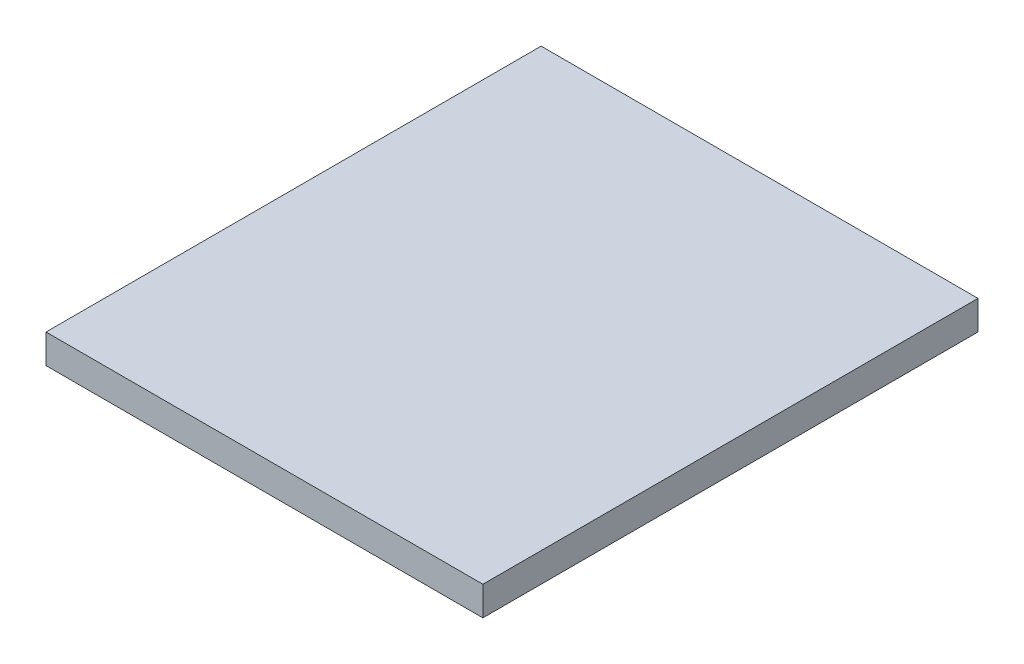
ISO-10303-21;
HEADER;
FILE_DESCRIPTION(('STEP AP214'),'2;1');
FILE_NAME('part.step','',(''),(''),'','','');
FILE_SCHEMA(('AUTOMOTIVE_DESIGN { 1 0 10303 214 1 1 1 1 }'));
ENDSEC;
DATA;
#1=APPLICATION_CONTEXT('core data for automotive mechanical design processes');
#2=APPLICATION_PROTOCOL_DEFINITION('international standard','automotive_design',2000,#1);
#3=PRODUCT_CONTEXT('',#1,'mechanical');
#4=PRODUCT('Part','Part','',(#3));
#5=PRODUCT_RELATED_PRODUCT_CATEGORY('part','',(#4));
#6=PRODUCT_DEFINITION_FORMATION('','',#4);
#7=PRODUCT_DEFINITION_CONTEXT('part definition',#1,'design');
#8=PRODUCT_DEFINITION('design','',#6,#7);
#9=PRODUCT_DEFINITION_SHAPE('','',#8);
#10=(LENGTH_UNIT() NAMED_UNIT(*) SI_UNIT(.MILLI.,.METRE.));
#11=(NAMED_UNIT(*) PLANE_ANGLE_UNIT() SI_UNIT($,.RADIAN.));
#12=(NAMED_UNIT(*) SI_UNIT($,.STERADIAN.) SOLID_ANGLE_UNIT());
#13=UNCERTAINTY_MEASURE_WITH_UNIT(LENGTH_MEASURE(1.E-05),#10,'distance_accuracy_value','');
#14=(GEOMETRIC_REPRESENTATION_CONTEXT(3) GLOBAL_UNCERTAINTY_ASSIGNED_CONTEXT((#13)) GLOBAL_UNIT_ASSIGNED_CONTEXT((#10,
#11,#12)) REPRESENTATION_CONTEXT('',''));
#15=CARTESIAN_POINT('',(0.,0.,0.));
#16=DIRECTION('',(0.,0.,1.));
#17=DIRECTION('',(1.,0.,0.));
#18=AXIS2_PLACEMENT_3D('',#15,#16,#17);
#19=CARTESIAN_POINT('',(-40.6455813487592,29.20892494929,340.));
#20=DIRECTION('',(1.,0.,0.));
#21=DIRECTION('',(0.,0.,-1.));
#22=AXIS2_PLACEMENT_3D('',#19,#20,#21);
#23=PLANE('',#22);
#24=DIRECTION('',(0.,-1.,0.));
#25=VECTOR('',#24,1.);
#26=CARTESIAN_POINT('',(-40.6455813487592,29.20892494929,0.));
#27=LINE('',#26,#25);
#28=CARTESIAN_POINT('',(-40.6455813487592,29.20892494929,0.));
#29=VERTEX_POINT('',#28);
#30=CARTESIAN_POINT('',(-40.6455813487592,9.20892494929004,0.));
#31=VERTEX_POINT('',#30);
#32=EDGE_CURVE('E96',#29,#31,#27,.T.);
#33=ORIENTED_EDGE('',*,*,#32,.T.);
#34=DIRECTION('',(0.,0.,-1.));
#35=VECTOR('',#34,1.);
#36=CARTESIAN_POINT('',(-40.6455813487592,9.20892494929004,340.));
#37=LINE('',#36,#35);
#38=CARTESIAN_POINT('',(-40.6455813487592,9.20892494929004,340.));
#39=VERTEX_POINT('',#38);
#40=EDGE_CURVE('E11',#39,#31,#37,.T.);
#41=ORIENTED_EDGE('',*,*,#40,.F.);
#42=DIRECTION('',(0.,-1.,0.));
#43=VECTOR('',#42,1.);
#44=CARTESIAN_POINT('',(-40.6455813487592,29.20892494929,340.));
#45=LINE('',#44,#43);
#46=CARTESIAN_POINT('',(-40.6455813487592,29.20892494929,340.));
#47=VERTEX_POINT('',#46);
#48=EDGE_CURVE('E84',#47,#39,#45,.T.);
#49=ORIENTED_EDGE('',*,*,#48,.F.);
#50=DIRECTION('',(0.,0.,-1.));
#51=VECTOR('',#50,1.);
#52=CARTESIAN_POINT('',(-40.6455813487592,29.20892494929,340.));
#53=LINE('',#52,#51);
#54=EDGE_CURVE('E92',#47,#29,#53,.T.);
#55=ORIENTED_EDGE('',*,*,#54,.T.);
#56=EDGE_LOOP('',(#33,#41,#49,#55));
#57=FACE_BOUND('',#56,.T.);
#58=ADVANCED_FACE('F33',(#57),#23,.F.);
#59=CARTESIAN_POINT('',(-40.6455813487592,9.20892494929004,340.));
#60=DIRECTION('',(0.,1.,0.));
#61=DIRECTION('',(0.,0.,1.));
#62=AXIS2_PLACEMENT_3D('',#59,#60,#61);
#63=PLANE('',#62);
#64=DIRECTION('',(1.,0.,0.));
#65=VECTOR('',#64,1.);
#66=CARTESIAN_POINT('',(-40.6455813487592,9.20892494929004,0.));
#67=LINE('',#66,#65);
#68=CARTESIAN_POINT('',(259.354418651241,9.20892494929004,0.));
#69=VERTEX_POINT('',#68);
#70=EDGE_CURVE('E88',#31,#69,#67,.T.);
#71=ORIENTED_EDGE('',*,*,#70,.T.);
#72=DIRECTION('',(0.,0.,-1.));
#73=VECTOR('',#72,1.);
#74=CARTESIAN_POINT('',(259.354418651241,9.20892494929004,340.));
#75=LINE('',#74,#73);
#76=CARTESIAN_POINT('',(259.354418651241,9.20892494929004,340.));
#77=VERTEX_POINT('',#76);
#78=EDGE_CURVE('E41',#77,#69,#75,.T.);
#79=ORIENTED_EDGE('',*,*,#78,.F.);
#80=DIRECTION('',(1.,0.,0.));
#81=VECTOR('',#80,1.);
#82=CARTESIAN_POINT('',(-40.6455813487592,9.20892494929004,340.));
#83=LINE('',#82,#81);
#84=EDGE_CURVE('E79',#39,#77,#83,.T.);
#85=ORIENTED_EDGE('',*,*,#84,.F.);
#86=ORIENTED_EDGE('',*,*,#40,.T.);
#87=EDGE_LOOP('',(#71,#79,#85,#86));
#88=FACE_BOUND('',#87,.T.);
#89=ADVANCED_FACE('F87',(#88),#63,.F.);
#90=CARTESIAN_POINT('',(259.354418651241,29.20892494929,340.));
#91=DIRECTION('',(-1.,0.,0.));
#92=DIRECTION('',(0.,0.,1.));
#93=AXIS2_PLACEMENT_3D('',#90,#91,#92);
#94=PLANE('',#93);
#95=DIRECTION('',(0.,1.,0.));
#96=VECTOR('',#95,1.);
#97=CARTESIAN_POINT('',(259.354418651241,29.20892494929,0.));
#98=LINE('',#97,#96);
#99=CARTESIAN_POINT('',(259.354418651241,29.20892494929,0.));
#100=VERTEX_POINT('',#99);
#101=EDGE_CURVE('E66',#69,#100,#98,.T.);
#102=ORIENTED_EDGE('',*,*,#101,.T.);
#103=DIRECTION('',(0.,0.,-1.));
#104=VECTOR('',#103,1.);
#105=CARTESIAN_POINT('',(259.354418651241,29.20892494929,340.));
#106=LINE('',#105,#104);
#107=CARTESIAN_POINT('',(259.354418651241,29.20892494929,340.));
#108=VERTEX_POINT('',#107);
#109=EDGE_CURVE('E89',#108,#100,#106,.T.);
#110=ORIENTED_EDGE('',*,*,#109,.F.);
#111=DIRECTION('',(0.,1.,0.));
#112=VECTOR('',#111,1.);
#113=CARTESIAN_POINT('',(259.354418651241,29.20892494929,340.));
#114=LINE('',#113,#112);
#115=EDGE_CURVE('E82',#77,#108,#114,.T.);
#116=ORIENTED_EDGE('',*,*,#115,.F.);
#117=ORIENTED_EDGE('',*,*,#78,.T.);
#118=EDGE_LOOP('',(#102,#110,#116,#117));
#119=FACE_BOUND('',#118,.T.);
#120=ADVANCED_FACE('F90',(#119),#94,.F.);
#121=CARTESIAN_POINT('',(-40.6455813487592,29.20892494929,340.));
#122=DIRECTION('',(0.,-1.,0.));
#123=DIRECTION('',(0.,0.,-1.));
#124=AXIS2_PLACEMENT_3D('',#121,#122,#123);
#125=PLANE('',#124);
#126=DIRECTION('',(-1.,0.,0.));
#127=VECTOR('',#126,1.);
#128=CARTESIAN_POINT('',(-40.6455813487592,29.20892494929,0.));
#129=LINE('',#128,#127);
#130=EDGE_CURVE('E72',#100,#29,#129,.T.);
#131=ORIENTED_EDGE('',*,*,#130,.T.);
#132=ORIENTED_EDGE('',*,*,#54,.F.);
#133=DIRECTION('',(-1.,0.,0.));
#134=VECTOR('',#133,1.);
#135=CARTESIAN_POINT('',(-40.6455813487592,29.20892494929,340.));
#136=LINE('',#135,#134);
#137=EDGE_CURVE('E49',#108,#47,#136,.T.);
#138=ORIENTED_EDGE('',*,*,#137,.F.);
#139=ORIENTED_EDGE('',*,*,#109,.T.);
#140=EDGE_LOOP('',(#131,#132,#138,#139));
#141=FACE_BOUND('',#140,.T.);
#142=ADVANCED_FACE('F103',(#141),#125,.F.);
#143=CARTESIAN_POINT('',(0.,0.,340.));
#144=DIRECTION('',(0.,0.,1.));
#145=DIRECTION('',(1.,0.,0.));
#146=AXIS2_PLACEMENT_3D('',#143,#144,#145);
#147=PLANE('',#146);
#148=ORIENTED_EDGE('',*,*,#48,.T.);
#149=ORIENTED_EDGE('',*,*,#84,.T.);
#150=ORIENTED_EDGE('',*,*,#115,.T.);
#151=ORIENTED_EDGE('',*,*,#137,.T.);
#152=EDGE_LOOP('',(#148,#149,#150,#151));
#153=FACE_BOUND('',#152,.T.);
#154=ADVANCED_FACE('F80',(#153),#147,.T.);
#155=CARTESIAN_POINT('',(0.,0.,0.));
#156=DIRECTION('',(0.,0.,1.));
#157=DIRECTION('',(1.,0.,0.));
#158=AXIS2_PLACEMENT_3D('',#155,#156,#157);
#159=PLANE('',#158);
#160=ORIENTED_EDGE('',*,*,#32,.F.);
#161=ORIENTED_EDGE('',*,*,#130,.F.);
#162=ORIENTED_EDGE('',*,*,#101,.F.);
#163=ORIENTED_EDGE('',*,*,#70,.F.);
#164=EDGE_LOOP('',(#160,#161,#162,#163));
#165=FACE_BOUND('',#164,.T.);
#166=ADVANCED_FACE('F106',(#165),#159,.F.);
#167=CLOSED_SHELL('',(#58,#89,#120,#142,#154,#166));
#168=MANIFOLD_SOLID_BREP('B2',#167);
#169=ADVANCED_BREP_SHAPE_REPRESENTATION('',(#18,#168),#14);
#170=SHAPE_DEFINITION_REPRESENTATION(#9,#169);
ENDSEC;
END-ISO-10303-21;
